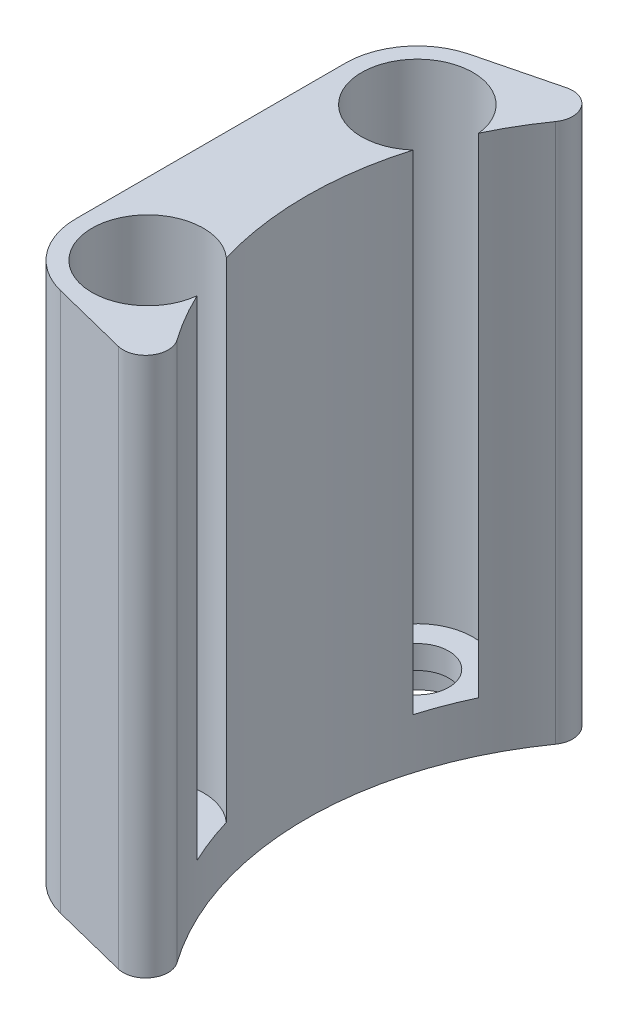
ISO-10303-21;
HEADER;
FILE_DESCRIPTION(('STEP AP214'),'2;1');
FILE_NAME('part.step','',(''),(''),'','','');
FILE_SCHEMA(('AUTOMOTIVE_DESIGN { 1 0 10303 214 1 1 1 1 }'));
ENDSEC;
DATA;
#1=APPLICATION_CONTEXT('core data for automotive mechanical design processes');
#2=APPLICATION_PROTOCOL_DEFINITION('international standard','automotive_design',2000,#1);
#3=PRODUCT_CONTEXT('',#1,'mechanical');
#4=PRODUCT('Part','Part','',(#3));
#5=PRODUCT_RELATED_PRODUCT_CATEGORY('part','',(#4));
#6=PRODUCT_DEFINITION_FORMATION('','',#4);
#7=PRODUCT_DEFINITION_CONTEXT('part definition',#1,'design');
#8=PRODUCT_DEFINITION('design','',#6,#7);
#9=PRODUCT_DEFINITION_SHAPE('','',#8);
#10=(LENGTH_UNIT() NAMED_UNIT(*) SI_UNIT(.MILLI.,.METRE.));
#11=(NAMED_UNIT(*) PLANE_ANGLE_UNIT() SI_UNIT($,.RADIAN.));
#12=(NAMED_UNIT(*) SI_UNIT($,.STERADIAN.) SOLID_ANGLE_UNIT());
#13=UNCERTAINTY_MEASURE_WITH_UNIT(LENGTH_MEASURE(1.E-05),#10,'distance_accuracy_value','');
#14=(GEOMETRIC_REPRESENTATION_CONTEXT(3) GLOBAL_UNCERTAINTY_ASSIGNED_CONTEXT((#13)) GLOBAL_UNIT_ASSIGNED_CONTEXT((#10,
#11,#12)) REPRESENTATION_CONTEXT('',''));
#15=CARTESIAN_POINT('',(0.,0.,0.));
#16=DIRECTION('',(0.,0.,1.));
#17=DIRECTION('',(1.,0.,0.));
#18=AXIS2_PLACEMENT_3D('',#15,#16,#17);
#19=CARTESIAN_POINT('',(-31.855140872393,-2.6,22.5));
#20=DIRECTION('',(0.,1.,0.));
#21=DIRECTION('',(0.,0.,1.));
#22=AXIS2_PLACEMENT_3D('',#19,#20,#21);
#23=PLANE('',#22);
#24=CARTESIAN_POINT('',(-39.1309387872333,-2.6,14.9999999999999));
#25=DIRECTION('',(0.,-1.,0.));
#26=DIRECTION('',(0.,0.,-1.));
#27=AXIS2_PLACEMENT_3D('',#24,#25,#26);
#28=CIRCLE('',#27,3.5);
#29=CARTESIAN_POINT('',(-39.1309387872333,-2.6,11.4999999999999));
#30=VERTEX_POINT('',#29);
#31=EDGE_CURVE('E186',#30,#30,#28,.T.);
#32=ORIENTED_EDGE('',*,*,#31,.F.);
#33=EDGE_LOOP('',(#32));
#34=FACE_BOUND('',#33,.T.);
#35=CARTESIAN_POINT('',(-39.1309387872333,-2.6,14.9999999999999));
#36=DIRECTION('',(0.,-1.,0.));
#37=DIRECTION('',(0.,0.,-1.));
#38=AXIS2_PLACEMENT_3D('',#35,#36,#37);
#39=CIRCLE('',#38,5.1);
#40=CARTESIAN_POINT('',(-39.1309387872333,-2.6,9.89999999999992));
#41=VERTEX_POINT('',#40);
#42=EDGE_CURVE('E225',#41,#41,#39,.T.);
#43=ORIENTED_EDGE('',*,*,#42,.T.);
#44=EDGE_LOOP('',(#43));
#45=FACE_BOUND('',#44,.T.);
#46=ADVANCED_FACE('F39',(#34,#45),#23,.F.);
#47=CARTESIAN_POINT('',(-39.1309387872333,-2.6,-15.0000000000001));
#48=DIRECTION('',(0.,-1.,0.));
#49=DIRECTION('',(0.,0.,-1.));
#50=AXIS2_PLACEMENT_3D('',#47,#48,#49);
#51=CIRCLE('',#50,3.5);
#52=CARTESIAN_POINT('',(-39.1309387872333,-2.6,-18.5000000000001));
#53=VERTEX_POINT('',#52);
#54=EDGE_CURVE('E193',#53,#53,#51,.T.);
#55=ORIENTED_EDGE('',*,*,#54,.F.);
#56=EDGE_LOOP('',(#55));
#57=FACE_BOUND('',#56,.T.);
#58=CARTESIAN_POINT('',(-39.1309387872333,-2.6,-15.0000000000001));
#59=DIRECTION('',(0.,-1.,0.));
#60=DIRECTION('',(0.,0.,-1.));
#61=AXIS2_PLACEMENT_3D('',#58,#59,#60);
#62=CIRCLE('',#61,5.1);
#63=CARTESIAN_POINT('',(-39.1309387872333,-2.6,-20.1000000000001));
#64=VERTEX_POINT('',#63);
#65=EDGE_CURVE('E231',#64,#64,#62,.T.);
#66=ORIENTED_EDGE('',*,*,#65,.T.);
#67=EDGE_LOOP('',(#66));
#68=FACE_BOUND('',#67,.T.);
#69=ADVANCED_FACE('F259',(#57,#68),#23,.F.);
#70=CARTESIAN_POINT('',(-15.9275704361965,54.4,-11.25));
#71=DIRECTION('',(0.,1.,0.));
#72=DIRECTION('',(0.,0.,1.));
#73=AXIS2_PLACEMENT_3D('',#70,#71,#72);
#74=PLANE('',#73);
#75=CARTESIAN_POINT('',(0.,54.4,0.));
#76=DIRECTION('',(0.,-1.,0.));
#77=DIRECTION('',(0.,0.,1.));
#78=AXIS2_PLACEMENT_3D('',#75,#76,#77);
#79=CIRCLE('',#78,36.5);
#80=CARTESIAN_POINT('',(-34.991734647589,54.4,10.3840505754123));
#81=VERTEX_POINT('',#80);
#82=CARTESIAN_POINT('',(-34.9917346475889,54.4,-10.3840505754124));
#83=VERTEX_POINT('',#82);
#84=EDGE_CURVE('E43',#81,#83,#79,.T.);
#85=ORIENTED_EDGE('',*,*,#84,.T.);
#86=CARTESIAN_POINT('',(-39.1309387872333,54.4,-15.0000000000001));
#87=DIRECTION('',(0.,1.,0.));
#88=DIRECTION('',(0.,0.,1.));
#89=AXIS2_PLACEMENT_3D('',#86,#87,#88);
#90=CIRCLE('',#89,6.2);
#91=CARTESIAN_POINT('',(-32.9668572576338,54.4,-15.6664074552782));
#92=VERTEX_POINT('',#91);
#93=EDGE_CURVE('E11',#92,#83,#90,.T.);
#94=ORIENTED_EDGE('',*,*,#93,.F.);
#95=CARTESIAN_POINT('',(-3.4035274598665E-12,54.4,-2.11462791721573E-12));
#96=DIRECTION('',(0.,1.,0.));
#97=DIRECTION('',(0.,0.,1.));
#98=AXIS2_PLACEMENT_3D('',#95,#96,#97);
#99=CIRCLE('',#98,36.499999999996);
#100=CARTESIAN_POINT('',(-29.8131446626242,54.4,-21.0576923076923));
#101=VERTEX_POINT('',#100);
#102=EDGE_CURVE('E112',#101,#92,#99,.T.);
#103=ORIENTED_EDGE('',*,*,#102,.F.);
#104=CARTESIAN_POINT('',(-31.8551408723929,54.4,-22.5));
#105=DIRECTION('',(0.,1.,0.));
#106=DIRECTION('',(0.,0.,1.));
#107=AXIS2_PLACEMENT_3D('',#104,#105,#106);
#108=CIRCLE('',#107,2.5);
#109=CARTESIAN_POINT('',(-32.4646004703067,54.4,-24.9245739828908));
#110=VERTEX_POINT('',#109);
#111=EDGE_CURVE('E132',#110,#101,#108,.F.);
#112=ORIENTED_EDGE('',*,*,#111,.F.);
#113=DIRECTION('',(0.969829593156306,0.,-0.243783839165508));
#114=VECTOR('',#113,1.);
#115=CARTESIAN_POINT('',(-41.0812095005574,54.4,-22.7586367452506));
#116=LINE('',#115,#114);
#117=CARTESIAN_POINT('',(-41.0812095005574,54.4,-22.7586367452506));
#118=VERTEX_POINT('',#117);
#119=EDGE_CURVE('E135',#118,#110,#116,.T.);
#120=ORIENTED_EDGE('',*,*,#119,.F.);
#121=CARTESIAN_POINT('',(-39.1309387872333,54.4,-15.0000000000001));
#122=DIRECTION('',(0.,1.,0.));
#123=DIRECTION('',(0.,0.,1.));
#124=AXIS2_PLACEMENT_3D('',#121,#122,#123);
#125=CIRCLE('',#124,8.00000000000001);
#126=CARTESIAN_POINT('',(-47.1309387872333,54.4,-15.0000000000001));
#127=VERTEX_POINT('',#126);
#128=EDGE_CURVE('E139',#127,#118,#125,.F.);
#129=ORIENTED_EDGE('',*,*,#128,.F.);
#130=DIRECTION('',(0.,0.,-1.));
#131=VECTOR('',#130,1.);
#132=CARTESIAN_POINT('',(-47.1309387872333,54.4,14.9999999999999));
#133=LINE('',#132,#131);
#134=CARTESIAN_POINT('',(-47.1309387872333,54.4,15.));
#135=VERTEX_POINT('',#134);
#136=EDGE_CURVE('E143',#135,#127,#133,.T.);
#137=ORIENTED_EDGE('',*,*,#136,.F.);
#138=CARTESIAN_POINT('',(-39.1309387872333,54.4,14.9999999999999));
#139=DIRECTION('',(0.,1.,0.));
#140=DIRECTION('',(0.,0.,1.));
#141=AXIS2_PLACEMENT_3D('',#138,#139,#140);
#142=CIRCLE('',#141,8.00000000000007);
#143=CARTESIAN_POINT('',(-41.0812095005575,54.4,22.7586367452504));
#144=VERTEX_POINT('',#143);
#145=EDGE_CURVE('E147',#144,#135,#142,.F.);
#146=ORIENTED_EDGE('',*,*,#145,.F.);
#147=DIRECTION('',(-0.969829593156302,0.,-0.243783839165523));
#148=VECTOR('',#147,1.);
#149=CARTESIAN_POINT('',(-41.0812095005575,54.4,22.7586367452504));
#150=LINE('',#149,#148);
#151=CARTESIAN_POINT('',(-32.4646004703068,54.4,24.9245739828908));
#152=VERTEX_POINT('',#151);
#153=EDGE_CURVE('E151',#152,#144,#150,.T.);
#154=ORIENTED_EDGE('',*,*,#153,.F.);
#155=CARTESIAN_POINT('',(-31.855140872393,54.4,22.5));
#156=DIRECTION('',(0.,1.,0.));
#157=DIRECTION('',(0.,0.,1.));
#158=AXIS2_PLACEMENT_3D('',#155,#156,#157);
#159=CIRCLE('',#158,2.50000000000001);
#160=CARTESIAN_POINT('',(-29.8131446626242,54.4,21.0576923076923));
#161=VERTEX_POINT('',#160);
#162=EDGE_CURVE('E155',#161,#152,#159,.F.);
#163=ORIENTED_EDGE('',*,*,#162,.F.);
#164=CARTESIAN_POINT('',(1.13450915328883E-12,54.4,-7.0603245472256E-13));
#165=DIRECTION('',(0.,1.,0.));
#166=DIRECTION('',(0.,0.,1.));
#167=AXIS2_PLACEMENT_3D('',#164,#165,#166);
#168=CIRCLE('',#167,36.5000000000013);
#169=CARTESIAN_POINT('',(-32.9668572576338,54.4,15.6664074552782));
#170=VERTEX_POINT('',#169);
#171=EDGE_CURVE('E159',#170,#161,#168,.T.);
#172=ORIENTED_EDGE('',*,*,#171,.F.);
#173=CARTESIAN_POINT('',(-39.1309387872333,54.4,15.));
#174=DIRECTION('',(0.,1.,0.));
#175=DIRECTION('',(0.,0.,1.));
#176=AXIS2_PLACEMENT_3D('',#173,#174,#175);
#177=CIRCLE('',#176,6.2);
#178=EDGE_CURVE('E49',#81,#170,#177,.T.);
#179=ORIENTED_EDGE('',*,*,#178,.F.);
#180=EDGE_LOOP('',(#85,#94,#103,#112,#120,#129,#137,#146,#154,#163,#172,#179));
#181=FACE_BOUND('',#180,.T.);
#182=ADVANCED_FACE('F110',(#181),#74,.T.);
#183=CARTESIAN_POINT('',(0.,54.4,0.));
#184=DIRECTION('',(0.,-1.,0.));
#185=DIRECTION('',(0.,0.,-1.));
#186=AXIS2_PLACEMENT_3D('',#183,#184,#185);
#187=CYLINDRICAL_SURFACE('',#186,36.5);
#188=DIRECTION('',(0.,1.,0.));
#189=VECTOR('',#188,1.);
#190=CARTESIAN_POINT('',(-34.991734647589,27.2,10.3840505754123));
#191=LINE('',#190,#189);
#192=CARTESIAN_POINT('',(-34.991734647589,0.,10.3840505754123));
#193=VERTEX_POINT('',#192);
#194=EDGE_CURVE('E69',#81,#193,#191,.F.);
#195=ORIENTED_EDGE('',*,*,#194,.T.);
#196=CARTESIAN_POINT('',(0.,0.,0.));
#197=DIRECTION('',(0.,1.,0.));
#198=DIRECTION('',(0.,0.,-1.));
#199=AXIS2_PLACEMENT_3D('',#196,#197,#198);
#200=CIRCLE('',#199,36.5);
#201=CARTESIAN_POINT('',(-32.9668572576338,0.,15.6664074552782));
#202=VERTEX_POINT('',#201);
#203=EDGE_CURVE('E128',#193,#202,#200,.T.);
#204=ORIENTED_EDGE('',*,*,#203,.T.);
#205=DIRECTION('',(0.,-1.,0.));
#206=VECTOR('',#205,1.);
#207=CARTESIAN_POINT('',(-32.9668572576338,107.465798698495,15.6664074552782));
#208=LINE('',#207,#206);
#209=EDGE_CURVE('E119',#170,#202,#208,.T.);
#210=ORIENTED_EDGE('',*,*,#209,.F.);
#211=ORIENTED_EDGE('',*,*,#171,.T.);
#212=DIRECTION('',(0.,-1.,0.));
#213=VECTOR('',#212,1.);
#214=CARTESIAN_POINT('',(-29.8131446626242,107.465798698495,21.0576923076923));
#215=LINE('',#214,#213);
#216=CARTESIAN_POINT('',(-29.8131446626242,-5.6,21.0576923076923));
#217=VERTEX_POINT('',#216);
#218=EDGE_CURVE('E158',#161,#217,#215,.T.);
#219=ORIENTED_EDGE('',*,*,#218,.T.);
#220=CARTESIAN_POINT('',(0.,-5.6,0.));
#221=DIRECTION('',(0.,1.,0.));
#222=DIRECTION('',(0.,0.,-1.));
#223=AXIS2_PLACEMENT_3D('',#220,#221,#222);
#224=CIRCLE('',#223,36.5);
#225=CARTESIAN_POINT('',(-29.8131446626242,-5.6,-21.0576923076923));
#226=VERTEX_POINT('',#225);
#227=EDGE_CURVE('E221',#226,#217,#224,.T.);
#228=ORIENTED_EDGE('',*,*,#227,.F.);
#229=DIRECTION('',(0.,-1.,0.));
#230=VECTOR('',#229,1.);
#231=CARTESIAN_POINT('',(-29.8131446626242,107.465798698495,-21.0576923076923));
#232=LINE('',#231,#230);
#233=EDGE_CURVE('E125',#101,#226,#232,.T.);
#234=ORIENTED_EDGE('',*,*,#233,.F.);
#235=ORIENTED_EDGE('',*,*,#102,.T.);
#236=DIRECTION('',(0.,-1.,0.));
#237=VECTOR('',#236,1.);
#238=CARTESIAN_POINT('',(-32.9668572576338,107.465798698495,-15.6664074552782));
#239=LINE('',#238,#237);
#240=CARTESIAN_POINT('',(-32.9668572576338,0.,-15.6664074552782));
#241=VERTEX_POINT('',#240);
#242=EDGE_CURVE('E115',#92,#241,#239,.T.);
#243=ORIENTED_EDGE('',*,*,#242,.T.);
#244=CARTESIAN_POINT('',(-34.9917346475889,0.,-10.3840505754124));
#245=VERTEX_POINT('',#244);
#246=EDGE_CURVE('E126',#241,#245,#200,.T.);
#247=ORIENTED_EDGE('',*,*,#246,.T.);
#248=DIRECTION('',(0.,1.,0.));
#249=VECTOR('',#248,1.);
#250=CARTESIAN_POINT('',(-34.9917346475889,27.2,-10.3840505754124));
#251=LINE('',#250,#249);
#252=EDGE_CURVE('E57',#245,#83,#251,.T.);
#253=ORIENTED_EDGE('',*,*,#252,.T.);
#254=ORIENTED_EDGE('',*,*,#84,.F.);
#255=EDGE_LOOP('',(#195,#204,#210,#211,#219,#228,#234,#235,#243,#247,#253,#254));
#256=FACE_BOUND('',#255,.T.);
#257=ADVANCED_FACE('F122',(#256),#187,.F.);
#258=CARTESIAN_POINT('',(-39.1309387872333,0.,15.));
#259=DIRECTION('',(0.,1.,0.));
#260=DIRECTION('',(0.,0.,1.));
#261=AXIS2_PLACEMENT_3D('',#258,#259,#260);
#262=CYLINDRICAL_SURFACE('',#261,6.2);
#263=ORIENTED_EDGE('',*,*,#209,.T.);
#264=CARTESIAN_POINT('',(-39.1309387872333,0.,15.));
#265=DIRECTION('',(0.,1.,0.));
#266=DIRECTION('',(0.,0.,1.));
#267=AXIS2_PLACEMENT_3D('',#264,#265,#266);
#268=CIRCLE('',#267,6.2);
#269=EDGE_CURVE('E74',#193,#202,#268,.T.);
#270=ORIENTED_EDGE('',*,*,#269,.F.);
#271=ORIENTED_EDGE('',*,*,#194,.F.);
#272=ORIENTED_EDGE('',*,*,#178,.T.);
#273=EDGE_LOOP('',(#263,#270,#271,#272));
#274=FACE_BOUND('',#273,.T.);
#275=ADVANCED_FACE('F302',(#274),#262,.F.);
#276=CARTESIAN_POINT('',(-39.1309387872333,0.,-15.0000000000001));
#277=DIRECTION('',(0.,1.,0.));
#278=DIRECTION('',(0.,0.,1.));
#279=AXIS2_PLACEMENT_3D('',#276,#277,#278);
#280=CYLINDRICAL_SURFACE('',#279,6.2);
#281=ORIENTED_EDGE('',*,*,#93,.T.);
#282=ORIENTED_EDGE('',*,*,#252,.F.);
#283=CARTESIAN_POINT('',(-39.1309387872333,0.,-15.0000000000001));
#284=DIRECTION('',(0.,1.,0.));
#285=DIRECTION('',(0.,0.,1.));
#286=AXIS2_PLACEMENT_3D('',#283,#284,#285);
#287=CIRCLE('',#286,6.2);
#288=EDGE_CURVE('E77',#241,#245,#287,.T.);
#289=ORIENTED_EDGE('',*,*,#288,.F.);
#290=ORIENTED_EDGE('',*,*,#242,.F.);
#291=EDGE_LOOP('',(#281,#282,#289,#290));
#292=FACE_BOUND('',#291,.T.);
#293=ADVANCED_FACE('F41',(#292),#280,.F.);
#294=CARTESIAN_POINT('',(-31.855140872393,107.465798698495,22.5));
#295=DIRECTION('',(0.,-1.,0.));
#296=DIRECTION('',(0.,0.,-1.));
#297=AXIS2_PLACEMENT_3D('',#294,#295,#296);
#298=CYLINDRICAL_SURFACE('',#297,2.50000000000001);
#299=ORIENTED_EDGE('',*,*,#218,.F.);
#300=ORIENTED_EDGE('',*,*,#162,.T.);
#301=DIRECTION('',(0.,-1.,0.));
#302=VECTOR('',#301,1.);
#303=CARTESIAN_POINT('',(-32.4646004703068,107.465798698495,24.9245739828908));
#304=LINE('',#303,#302);
#305=CARTESIAN_POINT('',(-32.4646004703068,-5.6,24.9245739828908));
#306=VERTEX_POINT('',#305);
#307=EDGE_CURVE('E154',#152,#306,#304,.T.);
#308=ORIENTED_EDGE('',*,*,#307,.T.);
#309=CARTESIAN_POINT('',(-31.855140872393,-5.6,22.5));
#310=DIRECTION('',(0.,-1.,0.));
#311=DIRECTION('',(0.,0.,-1.));
#312=AXIS2_PLACEMENT_3D('',#309,#310,#311);
#313=CIRCLE('',#312,2.5);
#314=EDGE_CURVE('E218',#217,#306,#313,.T.);
#315=ORIENTED_EDGE('',*,*,#314,.F.);
#316=EDGE_LOOP('',(#299,#300,#308,#315));
#317=FACE_BOUND('',#316,.T.);
#318=ADVANCED_FACE('F295',(#317),#298,.T.);
#319=CARTESIAN_POINT('',(-41.0812095005575,107.465798698495,22.7586367452504));
#320=DIRECTION('',(-0.243783839165523,0.,0.969829593156302));
#321=DIRECTION('',(0.969829593156302,0.,0.243783839165523));
#322=AXIS2_PLACEMENT_3D('',#319,#320,#321);
#323=PLANE('',#322);
#324=ORIENTED_EDGE('',*,*,#307,.F.);
#325=ORIENTED_EDGE('',*,*,#153,.T.);
#326=DIRECTION('',(0.,-1.,0.));
#327=VECTOR('',#326,1.);
#328=CARTESIAN_POINT('',(-41.0812095005575,107.465798698495,22.7586367452504));
#329=LINE('',#328,#327);
#330=CARTESIAN_POINT('',(-41.0812095005575,-5.6,22.7586367452504));
#331=VERTEX_POINT('',#330);
#332=EDGE_CURVE('E150',#144,#331,#329,.T.);
#333=ORIENTED_EDGE('',*,*,#332,.T.);
#334=DIRECTION('',(-0.969829593156302,0.,-0.243783839165523));
#335=VECTOR('',#334,1.);
#336=CARTESIAN_POINT('',(-32.4646004703068,-5.6,24.9245739828908));
#337=LINE('',#336,#335);
#338=EDGE_CURVE('E215',#306,#331,#337,.T.);
#339=ORIENTED_EDGE('',*,*,#338,.F.);
#340=EDGE_LOOP('',(#324,#325,#333,#339));
#341=FACE_BOUND('',#340,.T.);
#342=ADVANCED_FACE('F291',(#341),#323,.T.);
#343=CARTESIAN_POINT('',(-39.1309387872333,107.465798698495,14.9999999999999));
#344=DIRECTION('',(0.,-1.,0.));
#345=DIRECTION('',(0.,0.,-1.));
#346=AXIS2_PLACEMENT_3D('',#343,#344,#345);
#347=CYLINDRICAL_SURFACE('',#346,8.00000000000007);
#348=ORIENTED_EDGE('',*,*,#332,.F.);
#349=ORIENTED_EDGE('',*,*,#145,.T.);
#350=DIRECTION('',(0.,-1.,0.));
#351=VECTOR('',#350,1.);
#352=CARTESIAN_POINT('',(-47.1309387872333,107.465798698495,15.));
#353=LINE('',#352,#351);
#354=CARTESIAN_POINT('',(-47.1309387872333,-5.6,14.9999999999999));
#355=VERTEX_POINT('',#354);
#356=EDGE_CURVE('E146',#135,#355,#353,.T.);
#357=ORIENTED_EDGE('',*,*,#356,.T.);
#358=CARTESIAN_POINT('',(-39.1309387872333,-5.6,14.9999999999999));
#359=DIRECTION('',(0.,-1.,0.));
#360=DIRECTION('',(0.,0.,-1.));
#361=AXIS2_PLACEMENT_3D('',#358,#359,#360);
#362=CIRCLE('',#361,8.00000000000007);
#363=EDGE_CURVE('E212',#331,#355,#362,.T.);
#364=ORIENTED_EDGE('',*,*,#363,.F.);
#365=EDGE_LOOP('',(#348,#349,#357,#364));
#366=FACE_BOUND('',#365,.T.);
#367=ADVANCED_FACE('F287',(#366),#347,.T.);
#368=CARTESIAN_POINT('',(-47.1309387872333,107.465798698495,14.9999999999999));
#369=DIRECTION('',(-1.,0.,0.));
#370=DIRECTION('',(0.,0.,1.));
#371=AXIS2_PLACEMENT_3D('',#368,#369,#370);
#372=PLANE('',#371);
#373=ORIENTED_EDGE('',*,*,#356,.F.);
#374=ORIENTED_EDGE('',*,*,#136,.T.);
#375=DIRECTION('',(0.,-1.,0.));
#376=VECTOR('',#375,1.);
#377=CARTESIAN_POINT('',(-47.1309387872333,107.465798698495,-15.0000000000001));
#378=LINE('',#377,#376);
#379=CARTESIAN_POINT('',(-47.1309387872333,-5.6,-15.0000000000002));
#380=VERTEX_POINT('',#379);
#381=EDGE_CURVE('E142',#127,#380,#378,.T.);
#382=ORIENTED_EDGE('',*,*,#381,.T.);
#383=DIRECTION('',(0.,0.,-1.));
#384=VECTOR('',#383,1.);
#385=CARTESIAN_POINT('',(-47.1309387872333,-5.6,14.9999999999999));
#386=LINE('',#385,#384);
#387=EDGE_CURVE('E209',#355,#380,#386,.T.);
#388=ORIENTED_EDGE('',*,*,#387,.F.);
#389=EDGE_LOOP('',(#373,#374,#382,#388));
#390=FACE_BOUND('',#389,.T.);
#391=ADVANCED_FACE('F283',(#390),#372,.T.);
#392=CARTESIAN_POINT('',(-39.1309387872333,107.465798698495,-15.0000000000001));
#393=DIRECTION('',(0.,-1.,0.));
#394=DIRECTION('',(0.,0.,-1.));
#395=AXIS2_PLACEMENT_3D('',#392,#393,#394);
#396=CYLINDRICAL_SURFACE('',#395,8.00000000000001);
#397=ORIENTED_EDGE('',*,*,#381,.F.);
#398=ORIENTED_EDGE('',*,*,#128,.T.);
#399=DIRECTION('',(0.,-1.,0.));
#400=VECTOR('',#399,1.);
#401=CARTESIAN_POINT('',(-41.0812095005574,107.465798698495,-22.7586367452506));
#402=LINE('',#401,#400);
#403=CARTESIAN_POINT('',(-41.0812095005574,-5.6,-22.7586367452506));
#404=VERTEX_POINT('',#403);
#405=EDGE_CURVE('E138',#118,#404,#402,.T.);
#406=ORIENTED_EDGE('',*,*,#405,.T.);
#407=CARTESIAN_POINT('',(-39.1309387872333,-5.6,-15.0000000000001));
#408=DIRECTION('',(0.,-1.,0.));
#409=DIRECTION('',(0.,0.,-1.));
#410=AXIS2_PLACEMENT_3D('',#407,#408,#409);
#411=CIRCLE('',#410,8.00000000000005);
#412=EDGE_CURVE('E206',#380,#404,#411,.T.);
#413=ORIENTED_EDGE('',*,*,#412,.F.);
#414=EDGE_LOOP('',(#397,#398,#406,#413));
#415=FACE_BOUND('',#414,.T.);
#416=ADVANCED_FACE('F279',(#415),#396,.T.);
#417=CARTESIAN_POINT('',(-41.0812095005574,107.465798698495,-22.7586367452506));
#418=DIRECTION('',(-0.243783839165508,0.,-0.969829593156306));
#419=DIRECTION('',(-0.969829593156306,0.,0.243783839165508));
#420=AXIS2_PLACEMENT_3D('',#417,#418,#419);
#421=PLANE('',#420);
#422=ORIENTED_EDGE('',*,*,#405,.F.);
#423=ORIENTED_EDGE('',*,*,#119,.T.);
#424=DIRECTION('',(0.,-1.,0.));
#425=VECTOR('',#424,1.);
#426=CARTESIAN_POINT('',(-32.4646004703067,107.465798698495,-24.9245739828908));
#427=LINE('',#426,#425);
#428=CARTESIAN_POINT('',(-32.4646004703067,-5.6,-24.9245739828908));
#429=VERTEX_POINT('',#428);
#430=EDGE_CURVE('E134',#110,#429,#427,.T.);
#431=ORIENTED_EDGE('',*,*,#430,.T.);
#432=DIRECTION('',(0.969829593156306,0.,-0.243783839165507));
#433=VECTOR('',#432,1.);
#434=CARTESIAN_POINT('',(-41.0812095005574,-5.6,-22.7586367452506));
#435=LINE('',#434,#433);
#436=EDGE_CURVE('E203',#404,#429,#435,.T.);
#437=ORIENTED_EDGE('',*,*,#436,.F.);
#438=EDGE_LOOP('',(#422,#423,#431,#437));
#439=FACE_BOUND('',#438,.T.);
#440=ADVANCED_FACE('F275',(#439),#421,.T.);
#441=CARTESIAN_POINT('',(-31.8551408723929,107.465798698495,-22.5));
#442=DIRECTION('',(0.,-1.,0.));
#443=DIRECTION('',(0.,0.,-1.));
#444=AXIS2_PLACEMENT_3D('',#441,#442,#443);
#445=CYLINDRICAL_SURFACE('',#444,2.5);
#446=ORIENTED_EDGE('',*,*,#430,.F.);
#447=ORIENTED_EDGE('',*,*,#111,.T.);
#448=ORIENTED_EDGE('',*,*,#233,.T.);
#449=CARTESIAN_POINT('',(-31.8551408723929,-5.6,-22.5));
#450=DIRECTION('',(0.,-1.,0.));
#451=DIRECTION('',(0.,0.,-1.));
#452=AXIS2_PLACEMENT_3D('',#449,#450,#451);
#453=CIRCLE('',#452,2.5);
#454=EDGE_CURVE('E198',#429,#226,#453,.T.);
#455=ORIENTED_EDGE('',*,*,#454,.F.);
#456=EDGE_LOOP('',(#446,#447,#448,#455));
#457=FACE_BOUND('',#456,.T.);
#458=ADVANCED_FACE('F272',(#457),#445,.T.);
#459=CARTESIAN_POINT('',(-31.855140872393,0.,22.5));
#460=DIRECTION('',(0.,1.,0.));
#461=DIRECTION('',(0.,0.,1.));
#462=AXIS2_PLACEMENT_3D('',#459,#460,#461);
#463=PLANE('',#462);
#464=CARTESIAN_POINT('',(-39.1309387872333,0.,-15.0000000000001));
#465=DIRECTION('',(0.,-1.,0.));
#466=DIRECTION('',(0.,0.,-1.));
#467=AXIS2_PLACEMENT_3D('',#464,#465,#466);
#468=CIRCLE('',#467,3.5);
#469=CARTESIAN_POINT('',(-39.1309387872333,0.,-18.5000000000001));
#470=VERTEX_POINT('',#469);
#471=EDGE_CURVE('E195',#470,#470,#468,.T.);
#472=ORIENTED_EDGE('',*,*,#471,.T.);
#473=EDGE_LOOP('',(#472));
#474=FACE_BOUND('',#473,.T.);
#475=ORIENTED_EDGE('',*,*,#246,.F.);
#476=ORIENTED_EDGE('',*,*,#288,.T.);
#477=EDGE_LOOP('',(#475,#476));
#478=FACE_BOUND('',#477,.T.);
#479=ADVANCED_FACE('F269',(#474,#478),#463,.T.);
#480=CARTESIAN_POINT('',(-39.1309387872333,0.,14.9999999999999));
#481=DIRECTION('',(0.,-1.,0.));
#482=DIRECTION('',(0.,0.,-1.));
#483=AXIS2_PLACEMENT_3D('',#480,#481,#482);
#484=CIRCLE('',#483,3.5);
#485=CARTESIAN_POINT('',(-39.1309387872333,0.,11.4999999999999));
#486=VERTEX_POINT('',#485);
#487=EDGE_CURVE('E188',#486,#486,#484,.T.);
#488=ORIENTED_EDGE('',*,*,#487,.T.);
#489=EDGE_LOOP('',(#488));
#490=FACE_BOUND('',#489,.T.);
#491=ORIENTED_EDGE('',*,*,#203,.F.);
#492=ORIENTED_EDGE('',*,*,#269,.T.);
#493=EDGE_LOOP('',(#491,#492));
#494=FACE_BOUND('',#493,.T.);
#495=ADVANCED_FACE('F185',(#490,#494),#463,.T.);
#496=CARTESIAN_POINT('',(-39.1309387872333,-2.6,14.9999999999999));
#497=DIRECTION('',(0.,1.,0.));
#498=DIRECTION('',(0.,0.,1.));
#499=AXIS2_PLACEMENT_3D('',#496,#497,#498);
#500=CYLINDRICAL_SURFACE('',#499,3.5);
#501=ORIENTED_EDGE('',*,*,#31,.T.);
#502=EDGE_LOOP('',(#501));
#503=FACE_BOUND('',#502,.T.);
#504=ORIENTED_EDGE('',*,*,#487,.F.);
#505=EDGE_LOOP('',(#504));
#506=FACE_BOUND('',#505,.T.);
#507=ADVANCED_FACE('F253',(#503,#506),#500,.F.);
#508=CARTESIAN_POINT('',(-39.1309387872333,-2.6,-15.0000000000001));
#509=DIRECTION('',(0.,1.,0.));
#510=DIRECTION('',(0.,0.,1.));
#511=AXIS2_PLACEMENT_3D('',#508,#509,#510);
#512=CYLINDRICAL_SURFACE('',#511,3.5);
#513=ORIENTED_EDGE('',*,*,#54,.T.);
#514=EDGE_LOOP('',(#513));
#515=FACE_BOUND('',#514,.T.);
#516=ORIENTED_EDGE('',*,*,#471,.F.);
#517=EDGE_LOOP('',(#516));
#518=FACE_BOUND('',#517,.T.);
#519=ADVANCED_FACE('F243',(#515,#518),#512,.F.);
#520=CARTESIAN_POINT('',(0.,-5.6,0.));
#521=DIRECTION('',(0.,-1.,0.));
#522=DIRECTION('',(0.,0.,-1.));
#523=AXIS2_PLACEMENT_3D('',#520,#521,#522);
#524=PLANE('',#523);
#525=CARTESIAN_POINT('',(-39.1309387872333,-5.6,14.9999999999999));
#526=DIRECTION('',(0.,-1.,0.));
#527=DIRECTION('',(0.,0.,-1.));
#528=AXIS2_PLACEMENT_3D('',#525,#526,#527);
#529=CIRCLE('',#528,5.1);
#530=CARTESIAN_POINT('',(-39.1309387872333,-5.6,9.89999999999992));
#531=VERTEX_POINT('',#530);
#532=EDGE_CURVE('E224',#531,#531,#529,.T.);
#533=ORIENTED_EDGE('',*,*,#532,.F.);
#534=EDGE_LOOP('',(#533));
#535=FACE_BOUND('',#534,.T.);
#536=ORIENTED_EDGE('',*,*,#227,.T.);
#537=ORIENTED_EDGE('',*,*,#314,.T.);
#538=ORIENTED_EDGE('',*,*,#338,.T.);
#539=ORIENTED_EDGE('',*,*,#363,.T.);
#540=ORIENTED_EDGE('',*,*,#387,.T.);
#541=ORIENTED_EDGE('',*,*,#412,.T.);
#542=ORIENTED_EDGE('',*,*,#436,.T.);
#543=ORIENTED_EDGE('',*,*,#454,.T.);
#544=EDGE_LOOP('',(#536,#537,#538,#539,#540,#541,#542,#543));
#545=FACE_BOUND('',#544,.T.);
#546=CARTESIAN_POINT('',(-39.1309387872333,-5.6,-15.0000000000001));
#547=DIRECTION('',(0.,-1.,0.));
#548=DIRECTION('',(0.,0.,-1.));
#549=AXIS2_PLACEMENT_3D('',#546,#547,#548);
#550=CIRCLE('',#549,5.1);
#551=CARTESIAN_POINT('',(-39.1309387872333,-5.6,-20.1000000000001));
#552=VERTEX_POINT('',#551);
#553=EDGE_CURVE('E228',#552,#552,#550,.T.);
#554=ORIENTED_EDGE('',*,*,#553,.F.);
#555=EDGE_LOOP('',(#554));
#556=FACE_BOUND('',#555,.T.);
#557=ADVANCED_FACE('F240',(#535,#545,#556),#524,.T.);
#558=CARTESIAN_POINT('',(-39.1309387872333,-5.6,14.9999999999999));
#559=DIRECTION('',(0.,1.,0.));
#560=DIRECTION('',(0.,0.,1.));
#561=AXIS2_PLACEMENT_3D('',#558,#559,#560);
#562=CYLINDRICAL_SURFACE('',#561,5.1);
#563=ORIENTED_EDGE('',*,*,#532,.T.);
#564=EDGE_LOOP('',(#563));
#565=FACE_BOUND('',#564,.T.);
#566=ORIENTED_EDGE('',*,*,#42,.F.);
#567=EDGE_LOOP('',(#566));
#568=FACE_BOUND('',#567,.T.);
#569=ADVANCED_FACE('F242',(#565,#568),#562,.F.);
#570=CARTESIAN_POINT('',(-39.1309387872333,-5.6,-15.0000000000001));
#571=DIRECTION('',(0.,1.,0.));
#572=DIRECTION('',(0.,0.,1.));
#573=AXIS2_PLACEMENT_3D('',#570,#571,#572);
#574=CYLINDRICAL_SURFACE('',#573,5.1);
#575=ORIENTED_EDGE('',*,*,#553,.T.);
#576=EDGE_LOOP('',(#575));
#577=FACE_BOUND('',#576,.T.);
#578=ORIENTED_EDGE('',*,*,#65,.F.);
#579=EDGE_LOOP('',(#578));
#580=FACE_BOUND('',#579,.T.);
#581=ADVANCED_FACE('F237',(#577,#580),#574,.F.);
#582=CLOSED_SHELL('',(#46,#69,#182,#257,#275,#293,#318,#342,#367,#391,#416,#440,#458,#479,#495,
#507,#519,#557,#569,#581));
#583=MANIFOLD_SOLID_BREP('B2',#582);
#584=ADVANCED_BREP_SHAPE_REPRESENTATION('',(#18,#583),#14);
#585=SHAPE_DEFINITION_REPRESENTATION(#9,#584);
ENDSEC;
END-ISO-10303-21;
